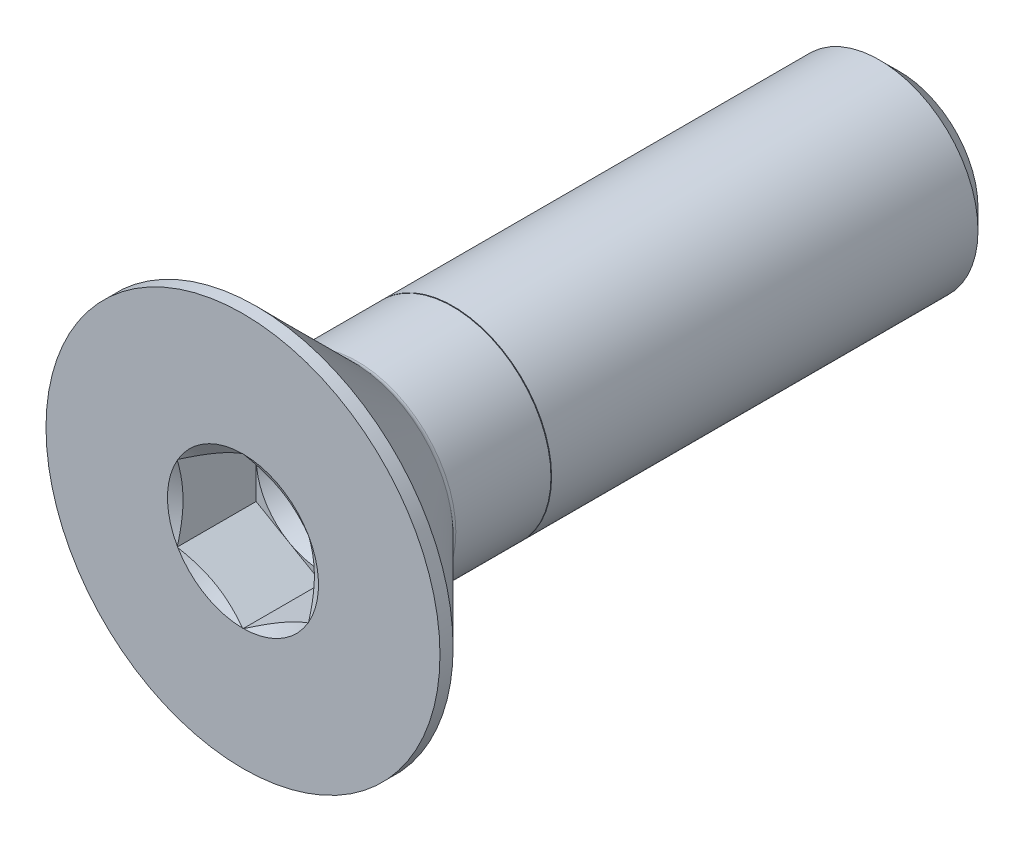
ISO-10303-21;
HEADER;
FILE_DESCRIPTION(('STEP AP214'),'2;1');
FILE_NAME('part.step','',(''),(''),'','','');
FILE_SCHEMA(('AUTOMOTIVE_DESIGN { 1 0 10303 214 1 1 1 1 }'));
ENDSEC;
DATA;
#1=APPLICATION_CONTEXT('core data for automotive mechanical design processes');
#2=APPLICATION_PROTOCOL_DEFINITION('international standard','automotive_design',2000,#1);
#3=PRODUCT_CONTEXT('',#1,'mechanical');
#4=PRODUCT('Part','Part','',(#3));
#5=PRODUCT_RELATED_PRODUCT_CATEGORY('part','',(#4));
#6=PRODUCT_DEFINITION_FORMATION('','',#4);
#7=PRODUCT_DEFINITION_CONTEXT('part definition',#1,'design');
#8=PRODUCT_DEFINITION('design','',#6,#7);
#9=PRODUCT_DEFINITION_SHAPE('','',#8);
#10=(LENGTH_UNIT() NAMED_UNIT(*) SI_UNIT(.MILLI.,.METRE.));
#11=(NAMED_UNIT(*) PLANE_ANGLE_UNIT() SI_UNIT($,.RADIAN.));
#12=(NAMED_UNIT(*) SI_UNIT($,.STERADIAN.) SOLID_ANGLE_UNIT());
#13=UNCERTAINTY_MEASURE_WITH_UNIT(LENGTH_MEASURE(1.E-05),#10,'distance_accuracy_value','');
#14=(GEOMETRIC_REPRESENTATION_CONTEXT(3) GLOBAL_UNCERTAINTY_ASSIGNED_CONTEXT((#13)) GLOBAL_UNIT_ASSIGNED_CONTEXT((#10,
#11,#12)) REPRESENTATION_CONTEXT('',''));
#15=CARTESIAN_POINT('',(0.,0.,0.));
#16=DIRECTION('',(0.,0.,1.));
#17=DIRECTION('',(1.,0.,0.));
#18=AXIS2_PLACEMENT_3D('',#15,#16,#17);
#19=CARTESIAN_POINT('',(0.,0.,1.25));
#20=DIRECTION('',(-1.,0.,0.));
#21=DIRECTION('',(0.,1.,0.));
#22=AXIS2_PLACEMENT_3D('',#19,#20,#21);
#23=SPHERICAL_SURFACE('',#22,1.25);
#24=CARTESIAN_POINT('',(-1.,0.,0.5));
#25=CARTESIAN_POINT('',(-0.999999918221247,-0.0281495245521416,0.5));
#26=CARTESIAN_POINT('',(-0.998810705131522,-0.0562856859630076,0.5));
#27=CARTESIAN_POINT('',(-0.994066576687322,-0.112356361404446,0.5));
#28=CARTESIAN_POINT('',(-0.990511783141581,-0.140290885742875,0.5));
#29=CARTESIAN_POINT('',(-0.976343201238138,-0.223384369013001,0.5));
#30=CARTESIAN_POINT('',(-0.962225042161326,-0.27798690137359,0.5));
#31=CARTESIAN_POINT('',(-0.925017617018385,-0.384066836858397,0.5));
#32=CARTESIAN_POINT('',(-0.901921159244324,-0.435541696368237,0.5));
#33=CARTESIAN_POINT('',(-0.847420007360541,-0.533893955867315,0.5));
#34=CARTESIAN_POINT('',(-0.816013396339763,-0.580770291686499,0.5));
#35=CARTESIAN_POINT('',(-0.742139756291213,-0.673099775905201,0.5));
#36=CARTESIAN_POINT('',(-0.698870858918713,-0.717918970422269,0.5));
#37=CARTESIAN_POINT('',(-0.628318945194335,-0.778580151446536,0.5));
#38=CARTESIAN_POINT('',(-0.603808211615082,-0.797736065958106,0.5));
#39=CARTESIAN_POINT('',(-0.553112162603095,-0.833685170069625,0.5));
#40=CARTESIAN_POINT('',(-0.526926888504461,-0.850478417956551,0.5));
#41=CARTESIAN_POINT('',(-0.5,-0.866025403784439,0.5));
#42=B_SPLINE_CURVE_WITH_KNOTS('',3,(#24,#25,#26,#27,#28,#29,#30,#31,#32,#33,#34,#35,#36,#37,#38,
#39,#40,#41),.UNSPECIFIED.,.F.,.F.,(4,2,2,2,2,2,2,2,4),(0.,0.0843969221510993,0.168789498862693,
0.337119537320777,0.505584688602224,0.674088733831015,0.859796862820128,0.953005960941174,
1.04621275919071),.UNSPECIFIED.);
#43=CARTESIAN_POINT('',(-1.,0.,0.5));
#44=VERTEX_POINT('',#43);
#45=CARTESIAN_POINT('',(-0.5,-0.866025403784438,0.5));
#46=VERTEX_POINT('',#45);
#47=EDGE_CURVE('E20',#44,#46,#42,.T.);
#48=ORIENTED_EDGE('',*,*,#47,.T.);
#49=CARTESIAN_POINT('',(-0.5,-0.866025403784439,0.5));
#50=CARTESIAN_POINT('',(-0.475621755744015,-0.880100095238032,0.5));
#51=CARTESIAN_POINT('',(-0.450660518652364,-0.89313828719725,0.5));
#52=CARTESIAN_POINT('',(-0.399729825090627,-0.917065089166476,0.5));
#53=CARTESIAN_POINT('',(-0.373760420598042,-0.927953809819869,0.5));
#54=CARTESIAN_POINT('',(-0.294715062245455,-0.95723019959095,0.500000000000001));
#55=CARTESIAN_POINT('',(-0.240368802571818,-0.972304781356058,0.500000000000003));
#56=CARTESIAN_POINT('',(-0.129897171038692,-0.993122173715266,0.500000000000003));
#57=CARTESIAN_POINT('',(-0.0737704061599044,-0.998857484300414,0.500000000000001));
#58=CARTESIAN_POINT('',(0.0386557250277878,-1.00083423198308,0.499999999999999));
#59=CARTESIAN_POINT('',(0.094955128193921,-0.997073476901905,0.500000000000001));
#60=CARTESIAN_POINT('',(0.211851627069907,-0.979261770059184,0.500000000000001));
#61=CARTESIAN_POINT('',(0.272300636785095,-0.964199402999392,0.5));
#62=CARTESIAN_POINT('',(0.360110717437866,-0.933430243940605,0.5));
#63=CARTESIAN_POINT('',(0.388955592827236,-0.921781283251364,0.5));
#64=CARTESIAN_POINT('',(0.445436454737096,-0.895851768991243,0.5));
#65=CARTESIAN_POINT('',(0.473072471068542,-0.881571280360231,0.500000000000001));
#66=CARTESIAN_POINT('',(0.500000000000001,-0.866025403784441,0.500000000000003));
#67=B_SPLINE_CURVE_WITH_KNOTS('',3,(#49,#50,#51,#52,#53,#54,#55,#56,#57,#58,#59,#60,#61,#62,#63,
#64,#65,#66),.UNSPECIFIED.,.F.,.F.,(4,2,2,2,2,2,2,2,4),(0.,0.0843969221510981,0.168789498862691,
0.337119537320774,0.50558468860222,0.674088733831011,0.859796862820125,0.953005960941173,
1.04621275919071),.UNSPECIFIED.);
#68=CARTESIAN_POINT('',(0.5,-0.866025403784439,0.5));
#69=VERTEX_POINT('',#68);
#70=EDGE_CURVE('E922',#46,#69,#67,.T.);
#71=ORIENTED_EDGE('',*,*,#70,.T.);
#72=CARTESIAN_POINT('',(0.5,-0.866025403784439,0.5));
#73=CARTESIAN_POINT('',(0.524378162477232,-0.851950570685891,0.5));
#74=CARTESIAN_POINT('',(0.548150186479159,-0.836852601234242,0.5));
#75=CARTESIAN_POINT('',(0.594336751596697,-0.80470872776203,0.5));
#76=CARTESIAN_POINT('',(0.61675136254354,-0.787662924076995,0.5));
#77=CARTESIAN_POINT('',(0.681628138992685,-0.73384583057795,0.5));
#78=CARTESIAN_POINT('',(0.721856239589512,-0.694317879982466,0.500000000000001));
#79=CARTESIAN_POINT('',(0.795120445979699,-0.609055336856868,0.500000000000001));
#80=CARTESIAN_POINT('',(0.828150753084425,-0.563315787932176,0.5));
#81=CARTESIAN_POINT('',(0.886075732388333,-0.466940276115767,0.5));
#82=CARTESIAN_POINT('',(0.910968524533688,-0.416303185215404,0.5));
#83=CARTESIAN_POINT('',(0.953991383361123,-0.306161994153981,0.5));
#84=CARTESIAN_POINT('',(0.971171495703811,-0.246280432577121,0.5));
#85=CARTESIAN_POINT('',(0.988429662632203,-0.154850092494069,0.5));
#86=CARTESIAN_POINT('',(0.992763804442319,-0.124045217293258,0.5));
#87=CARTESIAN_POINT('',(0.998548617340193,-0.0621665989216179,0.5));
#88=CARTESIAN_POINT('',(0.999999359573003,-0.0310928624036789,0.5));
#89=CARTESIAN_POINT('',(1.,0.,0.5));
#90=B_SPLINE_CURVE_WITH_KNOTS('',3,(#72,#73,#74,#75,#76,#77,#78,#79,#80,#81,#82,#83,#84,#85,#86,
#87,#88,#89),.UNSPECIFIED.,.F.,.F.,(4,2,2,2,2,2,2,2,4),(0.,0.0843969221510994,0.168789498862694,
0.337119537320778,0.505584688602225,0.674088733831016,0.859796862820128,0.953005960941174,
1.04621275919071),.UNSPECIFIED.);
#91=CARTESIAN_POINT('',(1.,0.,0.5));
#92=VERTEX_POINT('',#91);
#93=EDGE_CURVE('E927',#69,#92,#90,.T.);
#94=ORIENTED_EDGE('',*,*,#93,.T.);
#95=CARTESIAN_POINT('',(1.,0.,0.5));
#96=CARTESIAN_POINT('',(0.999999918221247,0.0281495245521418,0.5));
#97=CARTESIAN_POINT('',(0.998810705131522,0.0562856859630077,0.5));
#98=CARTESIAN_POINT('',(0.994066576687322,0.112356361404446,0.5));
#99=CARTESIAN_POINT('',(0.990511783141581,0.140290885742875,0.5));
#100=CARTESIAN_POINT('',(0.976343201238138,0.223384369013001,0.5));
#101=CARTESIAN_POINT('',(0.962225042161326,0.27798690137359,0.5));
#102=CARTESIAN_POINT('',(0.925017617018385,0.384066836858397,0.5));
#103=CARTESIAN_POINT('',(0.901921159244324,0.435541696368237,0.5));
#104=CARTESIAN_POINT('',(0.847420007360541,0.533893955867315,0.5));
#105=CARTESIAN_POINT('',(0.816013396339763,0.580770291686499,0.5));
#106=CARTESIAN_POINT('',(0.742139756291213,0.673099775905201,0.5));
#107=CARTESIAN_POINT('',(0.698870858918713,0.717918970422269,0.5));
#108=CARTESIAN_POINT('',(0.628318945194336,0.778580151446535,0.5));
#109=CARTESIAN_POINT('',(0.603808211615082,0.797736065958105,0.5));
#110=CARTESIAN_POINT('',(0.553112162603096,0.833685170069624,0.5));
#111=CARTESIAN_POINT('',(0.526926888504462,0.850478417956551,0.5));
#112=CARTESIAN_POINT('',(0.5,0.866025403784439,0.5));
#113=B_SPLINE_CURVE_WITH_KNOTS('',3,(#95,#96,#97,#98,#99,#100,#101,#102,#103,#104,#105,#106,
#107,#108,#109,#110,#111,#112),.UNSPECIFIED.,.F.,.F.,(4,2,2,2,2,2,2,2,4),(0.,0.0843969221510991,
0.168789498862693,0.337119537320777,0.505584688602224,0.674088733831015,0.859796862820127,
0.953005960941174,1.04621275919071),.UNSPECIFIED.);
#114=CARTESIAN_POINT('',(0.5,0.866025403784438,0.5));
#115=VERTEX_POINT('',#114);
#116=EDGE_CURVE('E383',#92,#115,#113,.T.);
#117=ORIENTED_EDGE('',*,*,#116,.T.);
#118=CARTESIAN_POINT('',(0.5,0.866025403784439,0.5));
#119=CARTESIAN_POINT('',(0.475621755744015,0.880100095238032,0.5));
#120=CARTESIAN_POINT('',(0.450660518652364,0.89313828719725,0.5));
#121=CARTESIAN_POINT('',(0.399729825090626,0.917065089166476,0.5));
#122=CARTESIAN_POINT('',(0.373760420598042,0.927953809819869,0.5));
#123=CARTESIAN_POINT('',(0.294715062245455,0.95723019959095,0.500000000000001));
#124=CARTESIAN_POINT('',(0.240368802571818,0.972304781356058,0.500000000000003));
#125=CARTESIAN_POINT('',(0.129897171038691,0.993122173715267,0.500000000000003));
#126=CARTESIAN_POINT('',(0.0737704061599038,0.998857484300414,0.500000000000001));
#127=CARTESIAN_POINT('',(-0.0386557250277884,1.00083423198308,0.499999999999999));
#128=CARTESIAN_POINT('',(-0.0949551281939217,0.997073476901905,0.500000000000001));
#129=CARTESIAN_POINT('',(-0.211851627069907,0.979261770059184,0.500000000000001));
#130=CARTESIAN_POINT('',(-0.272300636785095,0.964199402999392,0.5));
#131=CARTESIAN_POINT('',(-0.360110717437866,0.933430243940605,0.5));
#132=CARTESIAN_POINT('',(-0.388955592827235,0.921781283251364,0.5));
#133=CARTESIAN_POINT('',(-0.445436454737096,0.895851768991243,0.5));
#134=CARTESIAN_POINT('',(-0.473072471068541,0.881571280360231,0.500000000000001));
#135=CARTESIAN_POINT('',(-0.5,0.866025403784441,0.500000000000003));
#136=B_SPLINE_CURVE_WITH_KNOTS('',3,(#118,#119,#120,#121,#122,#123,#124,#125,#126,#127,#128,
#129,#130,#131,#132,#133,#134,#135),.UNSPECIFIED.,.F.,.F.,(4,2,2,2,2,2,2,2,4),(0.,
0.0843969221510984,0.168789498862692,0.337119537320774,0.505584688602221,0.674088733831012,
0.859796862820126,0.953005960941173,1.04621275919071),.UNSPECIFIED.);
#137=CARTESIAN_POINT('',(-0.499999999999999,0.866025403784439,0.5));
#138=VERTEX_POINT('',#137);
#139=EDGE_CURVE('E382',#115,#138,#136,.T.);
#140=ORIENTED_EDGE('',*,*,#139,.T.);
#141=CARTESIAN_POINT('',(-0.499999999999999,0.866025403784439,0.5));
#142=CARTESIAN_POINT('',(-0.524378162477231,0.851950570685891,0.5));
#143=CARTESIAN_POINT('',(-0.548150186479158,0.836852601234243,0.5));
#144=CARTESIAN_POINT('',(-0.594336751596696,0.804708727762031,0.5));
#145=CARTESIAN_POINT('',(-0.61675136254354,0.787662924076995,0.5));
#146=CARTESIAN_POINT('',(-0.681628138992685,0.73384583057795,0.5));
#147=CARTESIAN_POINT('',(-0.721856239589512,0.694317879982467,0.500000000000001));
#148=CARTESIAN_POINT('',(-0.795120445979698,0.609055336856869,0.500000000000001));
#149=CARTESIAN_POINT('',(-0.828150753084424,0.563315787932177,0.5));
#150=CARTESIAN_POINT('',(-0.886075732388333,0.466940276115768,0.5));
#151=CARTESIAN_POINT('',(-0.910968524533688,0.416303185215405,0.5));
#152=CARTESIAN_POINT('',(-0.953991383361123,0.306161994153982,0.5));
#153=CARTESIAN_POINT('',(-0.971171495703811,0.246280432577122,0.5));
#154=CARTESIAN_POINT('',(-0.988429662632203,0.15485009249407,0.5));
#155=CARTESIAN_POINT('',(-0.992763804442319,0.124045217293259,0.5));
#156=CARTESIAN_POINT('',(-0.998548617340193,0.0621665989216183,0.5));
#157=CARTESIAN_POINT('',(-0.999999359573004,0.0310928624036792,0.5));
#158=CARTESIAN_POINT('',(-1.,0.,0.5));
#159=B_SPLINE_CURVE_WITH_KNOTS('',3,(#141,#142,#143,#144,#145,#146,#147,#148,#149,#150,#151,
#152,#153,#154,#155,#156,#157,#158),.UNSPECIFIED.,.F.,.F.,(4,2,2,2,2,2,2,2,4),(0.,
0.0843969221510994,0.168789498862693,0.337119537320778,0.505584688602224,0.674088733831015,
0.859796862820128,0.953005960941175,1.04621275919071),.UNSPECIFIED.);
#160=EDGE_CURVE('E100',#138,#44,#159,.T.);
#161=ORIENTED_EDGE('',*,*,#160,.T.);
#162=EDGE_LOOP('',(#48,#71,#94,#117,#140,#161));
#163=FACE_BOUND('',#162,.T.);
#164=ADVANCED_FACE('F15',(#163),#23,.F.);
#165=CARTESIAN_POINT('',(1.,1.73205080756888,0.5));
#166=DIRECTION('',(0.,0.,-1.));
#167=DIRECTION('',(-1.,0.,0.));
#168=AXIS2_PLACEMENT_3D('',#165,#166,#167);
#169=PLANE('',#168);
#170=DIRECTION('',(0.,1.,0.));
#171=VECTOR('',#170,1.);
#172=CARTESIAN_POINT('',(-1.,-0.577350269189626,0.5));
#173=LINE('',#172,#171);
#174=CARTESIAN_POINT('',(-1.,-0.577350269189625,0.5));
#175=VERTEX_POINT('',#174);
#176=EDGE_CURVE('E107',#175,#44,#173,.T.);
#177=ORIENTED_EDGE('',*,*,#176,.F.);
#178=DIRECTION('',(-0.866025403784439,0.5,0.));
#179=VECTOR('',#178,1.);
#180=CARTESIAN_POINT('',(0.,-1.15470053837925,0.5));
#181=LINE('',#180,#179);
#182=EDGE_CURVE('E247',#46,#175,#181,.T.);
#183=ORIENTED_EDGE('',*,*,#182,.F.);
#184=ORIENTED_EDGE('',*,*,#47,.F.);
#185=EDGE_LOOP('',(#177,#183,#184));
#186=FACE_BOUND('',#185,.T.);
#187=ADVANCED_FACE('F644',(#186),#169,.F.);
#188=CARTESIAN_POINT('',(1.,1.73205080756888,0.5));
#189=DIRECTION('',(0.,0.,-1.));
#190=DIRECTION('',(-1.,0.,0.));
#191=AXIS2_PLACEMENT_3D('',#188,#189,#190);
#192=PLANE('',#191);
#193=DIRECTION('',(-0.866025403784439,0.5,0.));
#194=VECTOR('',#193,1.);
#195=CARTESIAN_POINT('',(0.,-1.15470053837925,0.5));
#196=LINE('',#195,#194);
#197=CARTESIAN_POINT('',(0.,-1.15470053837925,0.5));
#198=VERTEX_POINT('',#197);
#199=EDGE_CURVE('E282',#198,#46,#196,.T.);
#200=ORIENTED_EDGE('',*,*,#199,.F.);
#201=DIRECTION('',(-0.866025403784439,-0.5,0.));
#202=VECTOR('',#201,1.);
#203=CARTESIAN_POINT('',(1.,-0.577350269189626,0.5));
#204=LINE('',#203,#202);
#205=EDGE_CURVE('E240',#69,#198,#204,.T.);
#206=ORIENTED_EDGE('',*,*,#205,.F.);
#207=ORIENTED_EDGE('',*,*,#70,.F.);
#208=EDGE_LOOP('',(#200,#206,#207));
#209=FACE_BOUND('',#208,.T.);
#210=ADVANCED_FACE('F632',(#209),#192,.F.);
#211=CARTESIAN_POINT('',(1.,1.73205080756888,0.5));
#212=DIRECTION('',(0.,0.,-1.));
#213=DIRECTION('',(-1.,0.,0.));
#214=AXIS2_PLACEMENT_3D('',#211,#212,#213);
#215=PLANE('',#214);
#216=DIRECTION('',(-0.866025403784439,-0.5,0.));
#217=VECTOR('',#216,1.);
#218=CARTESIAN_POINT('',(1.,-0.577350269189626,0.5));
#219=LINE('',#218,#217);
#220=CARTESIAN_POINT('',(1.,-0.577350269189626,0.5));
#221=VERTEX_POINT('',#220);
#222=EDGE_CURVE('E273',#221,#69,#219,.T.);
#223=ORIENTED_EDGE('',*,*,#222,.F.);
#224=DIRECTION('',(0.,1.,0.));
#225=VECTOR('',#224,1.);
#226=CARTESIAN_POINT('',(1.,0.577350269189626,0.5));
#227=LINE('',#226,#225);
#228=EDGE_CURVE('E233',#92,#221,#227,.F.);
#229=ORIENTED_EDGE('',*,*,#228,.F.);
#230=ORIENTED_EDGE('',*,*,#93,.F.);
#231=EDGE_LOOP('',(#223,#229,#230));
#232=FACE_BOUND('',#231,.T.);
#233=ADVANCED_FACE('F621',(#232),#215,.F.);
#234=CARTESIAN_POINT('',(1.,1.73205080756888,0.5));
#235=DIRECTION('',(0.,0.,-1.));
#236=DIRECTION('',(-1.,0.,0.));
#237=AXIS2_PLACEMENT_3D('',#234,#235,#236);
#238=PLANE('',#237);
#239=DIRECTION('',(0.,1.,0.));
#240=VECTOR('',#239,1.);
#241=CARTESIAN_POINT('',(1.,0.577350269189626,0.5));
#242=LINE('',#241,#240);
#243=CARTESIAN_POINT('',(1.,0.577350269189624,0.5));
#244=VERTEX_POINT('',#243);
#245=EDGE_CURVE('E265',#244,#92,#242,.F.);
#246=ORIENTED_EDGE('',*,*,#245,.F.);
#247=DIRECTION('',(0.866025403784439,-0.5,0.));
#248=VECTOR('',#247,1.);
#249=CARTESIAN_POINT('',(0.,1.15470053837925,0.5));
#250=LINE('',#249,#248);
#251=EDGE_CURVE('E227',#115,#244,#250,.T.);
#252=ORIENTED_EDGE('',*,*,#251,.F.);
#253=ORIENTED_EDGE('',*,*,#116,.F.);
#254=EDGE_LOOP('',(#246,#252,#253));
#255=FACE_BOUND('',#254,.T.);
#256=ADVANCED_FACE('F393',(#255),#238,.F.);
#257=CARTESIAN_POINT('',(1.,1.73205080756888,0.5));
#258=DIRECTION('',(0.,0.,-1.));
#259=DIRECTION('',(-1.,0.,0.));
#260=AXIS2_PLACEMENT_3D('',#257,#258,#259);
#261=PLANE('',#260);
#262=DIRECTION('',(0.866025403784439,0.5,0.));
#263=VECTOR('',#262,1.);
#264=CARTESIAN_POINT('',(-1.,0.577350269189626,0.5));
#265=LINE('',#264,#263);
#266=CARTESIAN_POINT('',(-1.,0.577350269189626,0.5));
#267=VERTEX_POINT('',#266);
#268=EDGE_CURVE('E218',#267,#138,#265,.T.);
#269=ORIENTED_EDGE('',*,*,#268,.F.);
#270=DIRECTION('',(0.,1.,0.));
#271=VECTOR('',#270,1.);
#272=CARTESIAN_POINT('',(-1.,-0.577350269189626,0.5));
#273=LINE('',#272,#271);
#274=EDGE_CURVE('E260',#44,#267,#273,.T.);
#275=ORIENTED_EDGE('',*,*,#274,.F.);
#276=ORIENTED_EDGE('',*,*,#160,.F.);
#277=EDGE_LOOP('',(#269,#275,#276));
#278=FACE_BOUND('',#277,.T.);
#279=ADVANCED_FACE('F381',(#278),#261,.F.);
#280=CARTESIAN_POINT('',(1.,1.73205080756888,0.5));
#281=DIRECTION('',(0.,0.,-1.));
#282=DIRECTION('',(-1.,0.,0.));
#283=AXIS2_PLACEMENT_3D('',#280,#281,#282);
#284=PLANE('',#283);
#285=DIRECTION('',(0.866025403784439,-0.5,0.));
#286=VECTOR('',#285,1.);
#287=CARTESIAN_POINT('',(0.,1.15470053837925,0.5));
#288=LINE('',#287,#286);
#289=CARTESIAN_POINT('',(0.,1.15470053837925,0.5));
#290=VERTEX_POINT('',#289);
#291=EDGE_CURVE('E250',#290,#115,#288,.T.);
#292=ORIENTED_EDGE('',*,*,#291,.F.);
#293=DIRECTION('',(0.866025403784439,0.5,0.));
#294=VECTOR('',#293,1.);
#295=CARTESIAN_POINT('',(-1.,0.577350269189626,0.5));
#296=LINE('',#295,#294);
#297=EDGE_CURVE('E155',#138,#290,#296,.T.);
#298=ORIENTED_EDGE('',*,*,#297,.F.);
#299=ORIENTED_EDGE('',*,*,#139,.F.);
#300=EDGE_LOOP('',(#292,#298,#299));
#301=FACE_BOUND('',#300,.T.);
#302=ADVANCED_FACE('F387',(#301),#284,.F.);
#303=CARTESIAN_POINT('',(0.,0.,1.70000000008486));
#304=DIRECTION('',(0.,0.,1.));
#305=DIRECTION('',(1.,0.,0.));
#306=AXIS2_PLACEMENT_3D('',#303,#304,#305);
#307=CONICAL_SURFACE('',#306,1.15000000010923,1.04719755122045);
#308=CARTESIAN_POINT('',(-1.,0.567890834581807,1.7000000000223));
#309=CARTESIAN_POINT('',(-1.,0.517307283570297,1.68557228640608));
#310=CARTESIAN_POINT('',(-1.,0.466286843365992,1.67248535056143));
#311=CARTESIAN_POINT('',(-1.,0.363375742919932,1.6497210302096));
#312=CARTESIAN_POINT('',(-1.,0.311483350352291,1.64005156082042));
#313=CARTESIAN_POINT('',(-1.,0.208337012798557,1.62510771139287));
#314=CARTESIAN_POINT('',(-1.,0.157098286449418,1.61973205109716));
#315=CARTESIAN_POINT('',(-1.,0.0543986608337356,1.61350127394018));
#316=CARTESIAN_POINT('',(-1.,0.00293809753266549,1.61264079808044));
#317=CARTESIAN_POINT('',(-1.,-0.0919765232483634,1.61528923603533));
#318=CARTESIAN_POINT('',(-1.,-0.135450325752679,1.61814945267443));
#319=CARTESIAN_POINT('',(-1.,-0.22208711691931,1.62695146739236));
#320=CARTESIAN_POINT('',(-1.,-0.26525005663329,1.6328937404608));
#321=CARTESIAN_POINT('',(-1.,-0.352029208151982,1.6476476866478));
#322=CARTESIAN_POINT('',(-1.,-0.395635111577935,1.65651849403495));
#323=CARTESIAN_POINT('',(-1.,-0.482222992957887,1.67661181673736));
#324=CARTESIAN_POINT('',(-1.,-0.525205953111748,1.68783006810734));
#325=CARTESIAN_POINT('',(-1.,-0.567890834581807,1.7000000000223));
#326=B_SPLINE_CURVE_WITH_KNOTS('',3,(#308,#309,#310,#311,#312,#313,#314,#315,#316,#317,#318,
#319,#320,#321,#322,#323,#324,#325),.UNSPECIFIED.,.F.,.F.,(4,2,2,2,2,2,2,2,4),(0.,
0.157864083189179,0.316091432118757,0.470466224218563,0.624657749893881,0.755245826329913,
0.885854034266176,1.01927976317709,1.15246520657173),.UNSPECIFIED.);
#327=CARTESIAN_POINT('',(-1.,0.56789083463396,1.70000000003717));
#328=VERTEX_POINT('',#327);
#329=CARTESIAN_POINT('',(-1.,-0.56789083463396,1.70000000003717));
#330=VERTEX_POINT('',#329);
#331=EDGE_CURVE('E292',#328,#330,#326,.T.);
#332=ORIENTED_EDGE('',*,*,#331,.F.);
#333=CARTESIAN_POINT('',(0.,0.,1.70000000005204));
#334=DIRECTION('',(0.,0.,1.));
#335=DIRECTION('',(1.,0.,0.));
#336=AXIS2_PLACEMENT_3D('',#333,#334,#335);
#337=CIRCLE('',#336,1.15000000005239);
#338=EDGE_CURVE('E208',#328,#330,#337,.T.);
#339=ORIENTED_EDGE('',*,*,#338,.T.);
#340=EDGE_LOOP('',(#332,#339));
#341=FACE_BOUND('',#340,.T.);
#342=ADVANCED_FACE('F579',(#341),#307,.F.);
#343=CARTESIAN_POINT('',(-1.,-0.577350269189626,0.5));
#344=DIRECTION('',(1.,0.,0.));
#345=DIRECTION('',(0.,0.,-1.));
#346=AXIS2_PLACEMENT_3D('',#343,#344,#345);
#347=PLANE('',#346);
#348=ORIENTED_EDGE('',*,*,#274,.T.);
#349=DIRECTION('',(0.,0.,1.));
#350=VECTOR('',#349,1.);
#351=CARTESIAN_POINT('',(-1.,0.577350269189626,0.5));
#352=LINE('',#351,#350);
#353=CARTESIAN_POINT('',(-1.,0.577350269189626,1.7));
#354=VERTEX_POINT('',#353);
#355=EDGE_CURVE('E215',#354,#267,#352,.F.);
#356=ORIENTED_EDGE('',*,*,#355,.F.);
#357=DIRECTION('',(0.,1.,0.));
#358=VECTOR('',#357,1.);
#359=CARTESIAN_POINT('',(-1.,0.,1.7));
#360=LINE('',#359,#358);
#361=EDGE_CURVE('E156',#354,#328,#360,.F.);
#362=ORIENTED_EDGE('',*,*,#361,.T.);
#363=ORIENTED_EDGE('',*,*,#331,.T.);
#364=DIRECTION('',(0.,1.,0.));
#365=VECTOR('',#364,1.);
#366=CARTESIAN_POINT('',(-1.,0.,1.7));
#367=LINE('',#366,#365);
#368=CARTESIAN_POINT('',(-1.,-0.577350269189626,1.7));
#369=VERTEX_POINT('',#368);
#370=EDGE_CURVE('E204',#330,#369,#367,.F.);
#371=ORIENTED_EDGE('',*,*,#370,.T.);
#372=DIRECTION('',(0.,0.,1.));
#373=VECTOR('',#372,1.);
#374=CARTESIAN_POINT('',(-1.,-0.577350269189625,0.5));
#375=LINE('',#374,#373);
#376=EDGE_CURVE('E243',#175,#369,#375,.T.);
#377=ORIENTED_EDGE('',*,*,#376,.F.);
#378=ORIENTED_EDGE('',*,*,#176,.T.);
#379=EDGE_LOOP('',(#348,#356,#362,#363,#371,#377,#378));
#380=FACE_BOUND('',#379,.T.);
#381=ADVANCED_FACE('F377',(#380),#347,.T.);
#382=CARTESIAN_POINT('',(0.,0.,1.70000000008486));
#383=DIRECTION('',(0.,0.,1.));
#384=DIRECTION('',(1.,0.,0.));
#385=AXIS2_PLACEMENT_3D('',#382,#383,#384);
#386=CONICAL_SURFACE('',#385,1.15000000010923,1.04719755122801);
#387=CARTESIAN_POINT('',(-0.991807889324193,-0.582079986493534,1.7000000000223));
#388=CARTESIAN_POINT('',(-0.948001249134668,-0.607371761999248,1.68557228640635));
#389=CARTESIAN_POINT('',(-0.903816251805558,-0.632881982101353,1.67248535056195));
#390=CARTESIAN_POINT('',(-0.814692624488052,-0.684337532324271,1.64972103021056));
#391=CARTESIAN_POINT('',(-0.769752494261432,-0.710283728608027,1.64005156082156));
#392=CARTESIAN_POINT('',(-0.680425145632776,-0.761856897384777,1.62510771139427));
#393=CARTESIAN_POINT('',(-0.636051106956952,-0.787476260559295,1.61973205109864));
#394=CARTESIAN_POINT('',(-0.547110622214805,-0.838826073367029,1.61350127394173));
#395=CARTESIAN_POINT('',(-0.502544467103116,-0.864556355017509,1.61264079808197));
#396=CARTESIAN_POINT('',(-0.420345994316184,-0.912013665408021,1.61528923603674));
#397=CARTESIAN_POINT('',(-0.382696576948251,-0.933750566660229,1.61814945267577));
#398=CARTESIAN_POINT('',(-0.307666914895396,-0.977068962243652,1.62695146739352));
#399=CARTESIAN_POINT('',(-0.270286712600976,-0.998650432100698,1.63289374046186));
#400=CARTESIAN_POINT('',(-0.195133762866746,-1.04204000786015,1.6476476866486));
#401=CARTESIAN_POINT('',(-0.157369942744814,-1.06384295957318,1.65651849403561));
#402=CARTESIAN_POINT('',(-0.0823826378097128,-1.10713690026326,1.6766118167377));
#403=CARTESIAN_POINT('',(-0.045158302386513,-1.12862838034025,1.68783006810752));
#404=CARTESIAN_POINT('',(-0.00819211067580559,-1.14997082107534,1.7000000000223));
#405=B_SPLINE_CURVE_WITH_KNOTS('',3,(#387,#388,#389,#390,#391,#392,#393,#394,#395,#396,#397,
#398,#399,#400,#401,#402,#403,#404),.UNSPECIFIED.,.F.,.F.,(4,2,2,2,2,2,2,2,4),(0.,
0.15786408318872,0.316091432117823,0.470466224217302,0.624657749892301,0.755245826328625,
0.885854034265182,1.01927976317631,1.15246520657116),.UNSPECIFIED.);
#406=CARTESIAN_POINT('',(-0.991807889369357,-0.582079986467459,1.70000000003717));
#407=VERTEX_POINT('',#406);
#408=CARTESIAN_POINT('',(-0.00819211063063935,-1.14997082110142,1.70000000003717));
#409=VERTEX_POINT('',#408);
#410=EDGE_CURVE('E262',#407,#409,#405,.T.);
#411=ORIENTED_EDGE('',*,*,#410,.F.);
#412=CARTESIAN_POINT('',(0.,0.,1.70000000005204));
#413=DIRECTION('',(0.,0.,1.));
#414=DIRECTION('',(1.,0.,0.));
#415=AXIS2_PLACEMENT_3D('',#412,#413,#414);
#416=CIRCLE('',#415,1.15000000005239);
#417=EDGE_CURVE('E198',#407,#409,#416,.T.);
#418=ORIENTED_EDGE('',*,*,#417,.T.);
#419=EDGE_LOOP('',(#411,#418));
#420=FACE_BOUND('',#419,.T.);
#421=ADVANCED_FACE('F556',(#420),#386,.F.);
#422=CARTESIAN_POINT('',(0.,-1.15470053837925,0.5));
#423=DIRECTION('',(0.5,0.866025403784439,0.));
#424=DIRECTION('',(-0.866025403784439,0.5,0.));
#425=AXIS2_PLACEMENT_3D('',#422,#423,#424);
#426=PLANE('',#425);
#427=ORIENTED_EDGE('',*,*,#182,.T.);
#428=ORIENTED_EDGE('',*,*,#376,.T.);
#429=DIRECTION('',(0.866025403784398,-0.500000000000071,0.));
#430=VECTOR('',#429,1.);
#431=CARTESIAN_POINT('',(-1.,-0.577350269189626,1.7));
#432=LINE('',#431,#430);
#433=EDGE_CURVE('E201',#369,#407,#432,.T.);
#434=ORIENTED_EDGE('',*,*,#433,.T.);
#435=ORIENTED_EDGE('',*,*,#410,.T.);
#436=DIRECTION('',(0.866025403784379,-0.500000000000104,0.));
#437=VECTOR('',#436,1.);
#438=CARTESIAN_POINT('',(-0.00819211067734985,-1.14997082107445,1.7));
#439=LINE('',#438,#437);
#440=CARTESIAN_POINT('',(0.,-1.15470053837925,1.7));
#441=VERTEX_POINT('',#440);
#442=EDGE_CURVE('E194',#409,#441,#439,.T.);
#443=ORIENTED_EDGE('',*,*,#442,.T.);
#444=DIRECTION('',(0.,0.,1.));
#445=VECTOR('',#444,1.);
#446=CARTESIAN_POINT('',(0.,-1.15470053837925,0.5));
#447=LINE('',#446,#445);
#448=EDGE_CURVE('E236',#198,#441,#447,.T.);
#449=ORIENTED_EDGE('',*,*,#448,.F.);
#450=ORIENTED_EDGE('',*,*,#199,.T.);
#451=EDGE_LOOP('',(#427,#428,#434,#435,#443,#449,#450));
#452=FACE_BOUND('',#451,.T.);
#453=ADVANCED_FACE('F544',(#452),#426,.T.);
#454=CARTESIAN_POINT('',(0.,0.,1.70000000008486));
#455=DIRECTION('',(0.,0.,1.));
#456=DIRECTION('',(1.,0.,0.));
#457=AXIS2_PLACEMENT_3D('',#454,#455,#456);
#458=CONICAL_SURFACE('',#457,1.15000000010923,1.04719755113992);
#459=CARTESIAN_POINT('',(0.00819211067580504,-1.14997082107534,1.7000000000223));
#460=CARTESIAN_POINT('',(0.0519987508661326,-1.12467904556917,1.68557228640316));
#461=CARTESIAN_POINT('',(0.0961837481962076,-1.0991688254665,1.67248535055583));
#462=CARTESIAN_POINT('',(0.185307375515979,-1.04771327524228,1.64972103019938));
#463=CARTESIAN_POINT('',(0.230247505743901,-1.02176707895777,1.64005156080826));
#464=CARTESIAN_POINT('',(0.319574854374916,-0.970193910179658,1.62510771137795));
#465=CARTESIAN_POINT('',(0.363948893051787,-0.944574547004536,1.61973205108137));
#466=CARTESIAN_POINT('',(0.452889377796087,-0.893224734195559,1.6135012739237));
#467=CARTESIAN_POINT('',(0.497455532908883,-0.86749445254444,1.61264079806414));
#468=CARTESIAN_POINT('',(0.579654005695882,-0.820037142153889,1.61528923602027));
#469=CARTESIAN_POINT('',(0.617303423062794,-0.79830024090227,1.61814945266014));
#470=CARTESIAN_POINT('',(0.692333085113498,-0.754981845320089,1.62695146737998));
#471=CARTESIAN_POINT('',(0.729713287406789,-0.733400375463695,1.63289374044957));
#472=CARTESIAN_POINT('',(0.804866237138894,-0.69001079970547,1.64764768663923));
#473=CARTESIAN_POINT('',(0.842630057259824,-0.668207847993022,1.65651849402793));
#474=CARTESIAN_POINT('',(0.917617362192737,-0.624913907304201,1.67661181673368));
#475=CARTESIAN_POINT('',(0.954841697614751,-0.603422427227896,1.68783006810546));
#476=CARTESIAN_POINT('',(0.991807889324193,-0.582079986493534,1.7000000000223));
#477=B_SPLINE_CURVE_WITH_KNOTS('',3,(#459,#460,#461,#462,#463,#464,#465,#466,#467,#468,#469,
#470,#471,#472,#473,#474,#475,#476),.UNSPECIFIED.,.F.,.F.,(4,2,2,2,2,2,2,2,4),(0.,
0.157864083194066,0.316091432128706,0.470466224232002,0.624657749910719,0.755245826343643,
0.885854034276807,1.01927976318552,1.15246520657787),.UNSPECIFIED.);
#478=CARTESIAN_POINT('',(0.00819211063063814,-1.14997082110142,1.70000000003717));
#479=VERTEX_POINT('',#478);
#480=CARTESIAN_POINT('',(0.991807889369358,-0.582079986467459,1.70000000003717));
#481=VERTEX_POINT('',#480);
#482=EDGE_CURVE('E246',#479,#481,#477,.T.);
#483=ORIENTED_EDGE('',*,*,#482,.F.);
#484=CARTESIAN_POINT('',(0.,0.,1.70000000005204));
#485=DIRECTION('',(0.,0.,1.));
#486=DIRECTION('',(1.,0.,0.));
#487=AXIS2_PLACEMENT_3D('',#484,#485,#486);
#488=CIRCLE('',#487,1.15000000005239);
#489=EDGE_CURVE('E188',#479,#481,#488,.T.);
#490=ORIENTED_EDGE('',*,*,#489,.T.);
#491=EDGE_LOOP('',(#483,#490));
#492=FACE_BOUND('',#491,.T.);
#493=ADVANCED_FACE('F532',(#492),#458,.F.);
#494=CARTESIAN_POINT('',(1.,-0.577350269189626,0.5));
#495=DIRECTION('',(-0.5,0.866025403784439,0.));
#496=DIRECTION('',(-0.866025403784439,-0.5,0.));
#497=AXIS2_PLACEMENT_3D('',#494,#495,#496);
#498=PLANE('',#497);
#499=ORIENTED_EDGE('',*,*,#205,.T.);
#500=ORIENTED_EDGE('',*,*,#448,.T.);
#501=DIRECTION('',(0.866025403784379,0.500000000000104,0.));
#502=VECTOR('',#501,1.);
#503=CARTESIAN_POINT('',(0.,-1.15470053837925,1.7));
#504=LINE('',#503,#502);
#505=EDGE_CURVE('E191',#441,#479,#504,.T.);
#506=ORIENTED_EDGE('',*,*,#505,.T.);
#507=ORIENTED_EDGE('',*,*,#482,.T.);
#508=DIRECTION('',(0.866025403784431,0.500000000000013,0.));
#509=VECTOR('',#508,1.);
#510=CARTESIAN_POINT('',(0.991807889322649,-0.582079986494426,1.7));
#511=LINE('',#510,#509);
#512=CARTESIAN_POINT('',(1.,-0.577350269189626,1.7));
#513=VERTEX_POINT('',#512);
#514=EDGE_CURVE('E184',#481,#513,#511,.T.);
#515=ORIENTED_EDGE('',*,*,#514,.T.);
#516=DIRECTION('',(0.,0.,1.));
#517=VECTOR('',#516,1.);
#518=CARTESIAN_POINT('',(1.,-0.577350269189626,0.5));
#519=LINE('',#518,#517);
#520=EDGE_CURVE('E230',#221,#513,#519,.T.);
#521=ORIENTED_EDGE('',*,*,#520,.F.);
#522=ORIENTED_EDGE('',*,*,#222,.T.);
#523=EDGE_LOOP('',(#499,#500,#506,#507,#515,#521,#522));
#524=FACE_BOUND('',#523,.T.);
#525=ADVANCED_FACE('F520',(#524),#498,.T.);
#526=CARTESIAN_POINT('',(0.,0.,1.70000000008486));
#527=DIRECTION('',(0.,0.,1.));
#528=DIRECTION('',(1.,0.,0.));
#529=AXIS2_PLACEMENT_3D('',#526,#527,#528);
#530=CONICAL_SURFACE('',#529,1.15000000010923,1.04719755115654);
#531=CARTESIAN_POINT('',(1.,-0.567890834581809,1.7000000000223));
#532=CARTESIAN_POINT('',(1.,-0.517307283569627,1.68557228640376));
#533=CARTESIAN_POINT('',(1.,-0.466286843364514,1.67248535055698));
#534=CARTESIAN_POINT('',(1.,-0.363375742916556,1.64972103020149));
#535=CARTESIAN_POINT('',(1.,-0.311483350347824,1.64005156081077));
#536=CARTESIAN_POINT('',(1.,-0.208337012792114,1.62510771138103));
#537=CARTESIAN_POINT('',(1.,-0.157098286442097,1.61973205108463));
#538=CARTESIAN_POINT('',(1.,-0.0543986608246117,1.6135012739271));
#539=CARTESIAN_POINT('',(1.,-0.00293809752261503,1.6126407980675));
#540=CARTESIAN_POINT('',(1.,0.0919765232584707,1.61528923602338));
#541=CARTESIAN_POINT('',(1.,0.135450325761931,1.61814945266309));
#542=CARTESIAN_POINT('',(1.,0.222087116926761,1.62695146738253));
#543=CARTESIAN_POINT('',(1.,0.265250056639795,1.63289374045189));
#544=CARTESIAN_POINT('',(1.,0.352029208156709,1.647647686641));
#545=CARTESIAN_POINT('',(1.,0.395635111581823,1.65651849402938));
#546=CARTESIAN_POINT('',(1.,0.482222992959942,1.67661181673444));
#547=CARTESIAN_POINT('',(1.,0.52520595311281,1.68783006810585));
#548=CARTESIAN_POINT('',(1.,0.567890834581809,1.7000000000223));
#549=B_SPLINE_CURVE_WITH_KNOTS('',3,(#531,#532,#533,#534,#535,#536,#537,#538,#539,#540,#541,
#542,#543,#544,#545,#546,#547,#548),.UNSPECIFIED.,.F.,.F.,(4,2,2,2,2,2,2,2,4),(0.,
0.157864083193057,0.316091432126652,0.470466224229228,0.624657749907243,0.755245826340808,
0.885854034274612,1.01927976318378,1.1524652065766),.UNSPECIFIED.);
#550=CARTESIAN_POINT('',(1.,-0.567890834633961,1.70000000003717));
#551=VERTEX_POINT('',#550);
#552=CARTESIAN_POINT('',(1.,0.567890834633961,1.70000000003717));
#553=VERTEX_POINT('',#552);
#554=EDGE_CURVE('E239',#551,#553,#549,.T.);
#555=ORIENTED_EDGE('',*,*,#554,.F.);
#556=CARTESIAN_POINT('',(0.,0.,1.70000000005204));
#557=DIRECTION('',(0.,0.,1.));
#558=DIRECTION('',(1.,0.,0.));
#559=AXIS2_PLACEMENT_3D('',#556,#557,#558);
#560=CIRCLE('',#559,1.15000000005239);
#561=EDGE_CURVE('E178',#551,#553,#560,.T.);
#562=ORIENTED_EDGE('',*,*,#561,.T.);
#563=EDGE_LOOP('',(#555,#562));
#564=FACE_BOUND('',#563,.T.);
#565=ADVANCED_FACE('F409',(#564),#530,.F.);
#566=CARTESIAN_POINT('',(1.,0.577350269189626,0.5));
#567=DIRECTION('',(-1.,0.,0.));
#568=DIRECTION('',(0.,0.,1.));
#569=AXIS2_PLACEMENT_3D('',#566,#567,#568);
#570=PLANE('',#569);
#571=ORIENTED_EDGE('',*,*,#228,.T.);
#572=ORIENTED_EDGE('',*,*,#520,.T.);
#573=DIRECTION('',(0.,1.,0.));
#574=VECTOR('',#573,1.);
#575=CARTESIAN_POINT('',(1.,0.,1.7));
#576=LINE('',#575,#574);
#577=EDGE_CURVE('E181',#513,#551,#576,.T.);
#578=ORIENTED_EDGE('',*,*,#577,.T.);
#579=ORIENTED_EDGE('',*,*,#554,.T.);
#580=DIRECTION('',(0.,1.,0.));
#581=VECTOR('',#580,1.);
#582=CARTESIAN_POINT('',(1.,0.,1.7));
#583=LINE('',#582,#581);
#584=CARTESIAN_POINT('',(1.,0.577350269189626,1.7));
#585=VERTEX_POINT('',#584);
#586=EDGE_CURVE('E174',#553,#585,#583,.T.);
#587=ORIENTED_EDGE('',*,*,#586,.T.);
#588=DIRECTION('',(0.,0.,1.));
#589=VECTOR('',#588,1.);
#590=CARTESIAN_POINT('',(0.999999999999999,0.577350269189624,0.5));
#591=LINE('',#590,#589);
#592=EDGE_CURVE('E224',#244,#585,#591,.T.);
#593=ORIENTED_EDGE('',*,*,#592,.F.);
#594=ORIENTED_EDGE('',*,*,#245,.T.);
#595=EDGE_LOOP('',(#571,#572,#578,#579,#587,#593,#594));
#596=FACE_BOUND('',#595,.T.);
#597=ADVANCED_FACE('F396',(#596),#570,.T.);
#598=CARTESIAN_POINT('',(0.,0.,1.70000000008486));
#599=DIRECTION('',(0.,0.,1.));
#600=DIRECTION('',(1.,0.,0.));
#601=AXIS2_PLACEMENT_3D('',#598,#599,#600);
#602=CONICAL_SURFACE('',#601,1.15000000010923,1.04719755122801);
#603=CARTESIAN_POINT('',(0.991807889324194,0.582079986493532,1.7000000000223));
#604=CARTESIAN_POINT('',(0.948001249134669,0.607371761999247,1.68557228640635));
#605=CARTESIAN_POINT('',(0.903816251805559,0.632881982101351,1.67248535056195));
#606=CARTESIAN_POINT('',(0.814692624488054,0.684337532324269,1.64972103021056));
#607=CARTESIAN_POINT('',(0.769752494261433,0.710283728608025,1.64005156082156));
#608=CARTESIAN_POINT('',(0.680425145632778,0.761856897384775,1.62510771139427));
#609=CARTESIAN_POINT('',(0.636051106956953,0.787476260559293,1.61973205109864));
#610=CARTESIAN_POINT('',(0.547110622214806,0.838826073367028,1.61350127394173));
#611=CARTESIAN_POINT('',(0.502544467103117,0.864556355017508,1.61264079808197));
#612=CARTESIAN_POINT('',(0.420345994316185,0.912013665408019,1.61528923603674));
#613=CARTESIAN_POINT('',(0.382696576948252,0.933750566660228,1.61814945267577));
#614=CARTESIAN_POINT('',(0.307666914895396,0.977068962243651,1.62695146739352));
#615=CARTESIAN_POINT('',(0.270286712600976,0.998650432100697,1.63289374046186));
#616=CARTESIAN_POINT('',(0.195133762866746,1.04204000786015,1.6476476866486));
#617=CARTESIAN_POINT('',(0.157369942744813,1.06384295957318,1.65651849403561));
#618=CARTESIAN_POINT('',(0.0823826378097116,1.10713690026326,1.6766118167377));
#619=CARTESIAN_POINT('',(0.0451583023865116,1.12862838034025,1.68783006810752));
#620=CARTESIAN_POINT('',(0.00819211067580383,1.14997082107534,1.7000000000223));
#621=B_SPLINE_CURVE_WITH_KNOTS('',3,(#603,#604,#605,#606,#607,#608,#609,#610,#611,#612,#613,
#614,#615,#616,#617,#618,#619,#620),.UNSPECIFIED.,.F.,.F.,(4,2,2,2,2,2,2,2,4),(0.,
0.15786408318872,0.316091432117823,0.470466224217302,0.624657749892301,0.755245826328626,
0.885854034265183,1.01927976317631,1.15246520657116),.UNSPECIFIED.);
#622=CARTESIAN_POINT('',(0.991807889369358,0.582079986467457,1.70000000003717));
#623=VERTEX_POINT('',#622);
#624=CARTESIAN_POINT('',(0.00819211063063755,1.14997082110142,1.70000000003717));
#625=VERTEX_POINT('',#624);
#626=EDGE_CURVE('E143',#623,#625,#621,.T.);
#627=ORIENTED_EDGE('',*,*,#626,.F.);
#628=CARTESIAN_POINT('',(0.,0.,1.70000000005204));
#629=DIRECTION('',(0.,0.,1.));
#630=DIRECTION('',(1.,0.,0.));
#631=AXIS2_PLACEMENT_3D('',#628,#629,#630);
#632=CIRCLE('',#631,1.15000000005239);
#633=EDGE_CURVE('E148',#623,#625,#632,.T.);
#634=ORIENTED_EDGE('',*,*,#633,.T.);
#635=EDGE_LOOP('',(#627,#634));
#636=FACE_BOUND('',#635,.T.);
#637=ADVANCED_FACE('F402',(#636),#602,.F.);
#638=CARTESIAN_POINT('',(0.,1.15470053837925,0.5));
#639=DIRECTION('',(-0.5,-0.866025403784439,0.));
#640=DIRECTION('',(0.866025403784439,-0.5,0.));
#641=AXIS2_PLACEMENT_3D('',#638,#639,#640);
#642=PLANE('',#641);
#643=ORIENTED_EDGE('',*,*,#251,.T.);
#644=ORIENTED_EDGE('',*,*,#592,.T.);
#645=DIRECTION('',(-0.866025403784441,0.499999999999995,0.));
#646=VECTOR('',#645,1.);
#647=CARTESIAN_POINT('',(1.,0.577350269189626,1.7));
#648=LINE('',#647,#646);
#649=EDGE_CURVE('E172',#585,#623,#648,.T.);
#650=ORIENTED_EDGE('',*,*,#649,.T.);
#651=ORIENTED_EDGE('',*,*,#626,.T.);
#652=DIRECTION('',(-0.866025403784379,0.500000000000104,0.));
#653=VECTOR('',#652,1.);
#654=CARTESIAN_POINT('',(0.00819211067734811,1.14997082107445,1.7));
#655=LINE('',#654,#653);
#656=CARTESIAN_POINT('',(0.,1.15470053837925,1.7));
#657=VERTEX_POINT('',#656);
#658=EDGE_CURVE('E135',#625,#657,#655,.T.);
#659=ORIENTED_EDGE('',*,*,#658,.T.);
#660=DIRECTION('',(0.,0.,1.));
#661=VECTOR('',#660,1.);
#662=CARTESIAN_POINT('',(0.,1.15470053837925,0.5));
#663=LINE('',#662,#661);
#664=EDGE_CURVE('E140',#290,#657,#663,.T.);
#665=ORIENTED_EDGE('',*,*,#664,.F.);
#666=ORIENTED_EDGE('',*,*,#291,.T.);
#667=EDGE_LOOP('',(#643,#644,#650,#651,#659,#665,#666));
#668=FACE_BOUND('',#667,.T.);
#669=ADVANCED_FACE('F138',(#668),#642,.T.);
#670=CARTESIAN_POINT('',(0.,0.,1.70000000008486));
#671=DIRECTION('',(0.,0.,1.));
#672=DIRECTION('',(1.,0.,0.));
#673=AXIS2_PLACEMENT_3D('',#670,#671,#672);
#674=CONICAL_SURFACE('',#673,1.15000000010923,1.04719755113992);
#675=CARTESIAN_POINT('',(-0.00819211067580632,1.14997082107534,1.7000000000223));
#676=CARTESIAN_POINT('',(-0.0519987508661339,1.12467904556916,1.68557228640316));
#677=CARTESIAN_POINT('',(-0.096183748196209,1.0991688254665,1.67248535055583));
#678=CARTESIAN_POINT('',(-0.18530737551598,1.04771327524228,1.64972103019938));
#679=CARTESIAN_POINT('',(-0.230247505743902,1.02176707895777,1.64005156080826));
#680=CARTESIAN_POINT('',(-0.319574854374917,0.970193910179658,1.62510771137795));
#681=CARTESIAN_POINT('',(-0.363948893051788,0.944574547004535,1.61973205108137));
#682=CARTESIAN_POINT('',(-0.452889377796088,0.893224734195558,1.6135012739237));
#683=CARTESIAN_POINT('',(-0.497455532908884,0.867494452544439,1.61264079806414));
#684=CARTESIAN_POINT('',(-0.579654005695883,0.820037142153889,1.61528923602027));
#685=CARTESIAN_POINT('',(-0.617303423062795,0.79830024090227,1.61814945266014));
#686=CARTESIAN_POINT('',(-0.692333085113499,0.754981845320089,1.62695146737998));
#687=CARTESIAN_POINT('',(-0.729713287406789,0.733400375463695,1.63289374044957));
#688=CARTESIAN_POINT('',(-0.804866237138894,0.69001079970547,1.64764768663923));
#689=CARTESIAN_POINT('',(-0.842630057259824,0.668207847993022,1.65651849402793));
#690=CARTESIAN_POINT('',(-0.917617362192736,0.624913907304201,1.67661181673368));
#691=CARTESIAN_POINT('',(-0.95484169761475,0.603422427227897,1.68783006810546));
#692=CARTESIAN_POINT('',(-0.991807889324193,0.582079986493535,1.7000000000223));
#693=B_SPLINE_CURVE_WITH_KNOTS('',3,(#675,#676,#677,#678,#679,#680,#681,#682,#683,#684,#685,
#686,#687,#688,#689,#690,#691,#692),.UNSPECIFIED.,.F.,.F.,(4,2,2,2,2,2,2,2,4),(0.,
0.157864083194066,0.316091432128706,0.470466224232002,0.624657749910718,0.755245826343642,
0.885854034276806,1.01927976318552,1.15246520657786),.UNSPECIFIED.);
#694=CARTESIAN_POINT('',(-0.00819211063063966,1.14997082110142,1.70000000003717));
#695=VERTEX_POINT('',#694);
#696=CARTESIAN_POINT('',(-0.991807889369358,0.582079986467459,1.70000000003717));
#697=VERTEX_POINT('',#696);
#698=EDGE_CURVE('E219',#695,#697,#693,.T.);
#699=ORIENTED_EDGE('',*,*,#698,.F.);
#700=CARTESIAN_POINT('',(0.,0.,1.70000000005204));
#701=DIRECTION('',(0.,0.,1.));
#702=DIRECTION('',(1.,0.,0.));
#703=AXIS2_PLACEMENT_3D('',#700,#701,#702);
#704=CIRCLE('',#703,1.15000000005239);
#705=EDGE_CURVE('E37',#695,#697,#704,.T.);
#706=ORIENTED_EDGE('',*,*,#705,.T.);
#707=EDGE_LOOP('',(#699,#706));
#708=FACE_BOUND('',#707,.T.);
#709=ADVANCED_FACE('F336',(#708),#674,.F.);
#710=CARTESIAN_POINT('',(-1.,0.577350269189626,0.5));
#711=DIRECTION('',(0.5,-0.866025403784439,0.));
#712=DIRECTION('',(0.866025403784439,0.5,0.));
#713=AXIS2_PLACEMENT_3D('',#710,#711,#712);
#714=PLANE('',#713);
#715=ORIENTED_EDGE('',*,*,#297,.T.);
#716=ORIENTED_EDGE('',*,*,#664,.T.);
#717=DIRECTION('',(-0.866025403784379,-0.500000000000104,0.));
#718=VECTOR('',#717,1.);
#719=CARTESIAN_POINT('',(0.,1.15470053837925,1.7));
#720=LINE('',#719,#718);
#721=EDGE_CURVE('E147',#657,#695,#720,.T.);
#722=ORIENTED_EDGE('',*,*,#721,.T.);
#723=ORIENTED_EDGE('',*,*,#698,.T.);
#724=DIRECTION('',(-0.866025403784398,-0.500000000000071,0.));
#725=VECTOR('',#724,1.);
#726=CARTESIAN_POINT('',(-0.991807889322648,0.582079986494427,1.7));
#727=LINE('',#726,#725);
#728=EDGE_CURVE('E162',#697,#354,#727,.T.);
#729=ORIENTED_EDGE('',*,*,#728,.T.);
#730=ORIENTED_EDGE('',*,*,#355,.T.);
#731=ORIENTED_EDGE('',*,*,#268,.T.);
#732=EDGE_LOOP('',(#715,#716,#722,#723,#729,#730,#731));
#733=FACE_BOUND('',#732,.T.);
#734=ADVANCED_FACE('F152',(#733),#714,.T.);
#735=CARTESIAN_POINT('',(3.,0.,1.7));
#736=DIRECTION('',(0.,0.,-1.));
#737=DIRECTION('',(-1.,0.,0.));
#738=AXIS2_PLACEMENT_3D('',#735,#736,#737);
#739=PLANE('',#738);
#740=ORIENTED_EDGE('',*,*,#705,.F.);
#741=ORIENTED_EDGE('',*,*,#721,.F.);
#742=ORIENTED_EDGE('',*,*,#658,.F.);
#743=ORIENTED_EDGE('',*,*,#633,.F.);
#744=ORIENTED_EDGE('',*,*,#649,.F.);
#745=ORIENTED_EDGE('',*,*,#586,.F.);
#746=ORIENTED_EDGE('',*,*,#561,.F.);
#747=ORIENTED_EDGE('',*,*,#577,.F.);
#748=ORIENTED_EDGE('',*,*,#514,.F.);
#749=ORIENTED_EDGE('',*,*,#489,.F.);
#750=ORIENTED_EDGE('',*,*,#505,.F.);
#751=ORIENTED_EDGE('',*,*,#442,.F.);
#752=ORIENTED_EDGE('',*,*,#417,.F.);
#753=ORIENTED_EDGE('',*,*,#433,.F.);
#754=ORIENTED_EDGE('',*,*,#370,.F.);
#755=ORIENTED_EDGE('',*,*,#338,.F.);
#756=ORIENTED_EDGE('',*,*,#361,.F.);
#757=ORIENTED_EDGE('',*,*,#728,.F.);
#758=EDGE_LOOP('',(#740,#741,#742,#743,#744,#745,#746,#747,#748,#749,#750,#751,#752,#753,#754,
#755,#756,#757));
#759=FACE_BOUND('',#758,.T.);
#760=CARTESIAN_POINT('',(0.,0.,1.7));
#761=DIRECTION('',(0.,0.,-1.));
#762=DIRECTION('',(-1.,0.,0.));
#763=AXIS2_PLACEMENT_3D('',#760,#761,#762);
#764=CIRCLE('',#763,3.);
#765=CARTESIAN_POINT('',(-3.,0.,1.7));
#766=VERTEX_POINT('',#765);
#767=EDGE_CURVE('E315',#766,#766,#764,.T.);
#768=ORIENTED_EDGE('',*,*,#767,.F.);
#769=EDGE_LOOP('',(#768));
#770=FACE_BOUND('',#769,.T.);
#771=ADVANCED_FACE('F158',(#759,#770),#739,.F.);
#772=CARTESIAN_POINT('',(0.,0.,54.));
#773=DIRECTION('',(0.,0.,-1.));
#774=DIRECTION('',(-1.,0.,0.));
#775=AXIS2_PLACEMENT_3D('',#772,#773,#774);
#776=CYLINDRICAL_SURFACE('',#775,3.);
#777=CARTESIAN_POINT('',(0.,0.,1.49999999996453));
#778=DIRECTION('',(0.,0.,1.));
#779=DIRECTION('',(1.,0.,0.));
#780=AXIS2_PLACEMENT_3D('',#777,#778,#779);
#781=CIRCLE('',#780,2.9999999999859);
#782=CARTESIAN_POINT('',(2.9999999999859,0.,1.49999999996453));
#783=VERTEX_POINT('',#782);
#784=EDGE_CURVE('E317',#783,#783,#781,.F.);
#785=ORIENTED_EDGE('',*,*,#784,.F.);
#786=EDGE_LOOP('',(#785));
#787=FACE_BOUND('',#786,.T.);
#788=ORIENTED_EDGE('',*,*,#767,.T.);
#789=EDGE_LOOP('',(#788));
#790=FACE_BOUND('',#789,.T.);
#791=ADVANCED_FACE('F343',(#787,#790),#776,.T.);
#792=CARTESIAN_POINT('',(0.,0.,1.49999999990769));
#793=DIRECTION('',(0.,0.,1.));
#794=DIRECTION('',(1.,0.,0.));
#795=AXIS2_PLACEMENT_3D('',#792,#793,#794);
#796=CONICAL_SURFACE('',#795,2.99999999987222,0.785398163378123);
#797=ORIENTED_EDGE('',*,*,#784,.T.);
#798=EDGE_LOOP('',(#797));
#799=FACE_BOUND('',#798,.T.);
#800=CARTESIAN_POINT('',(0.,0.,0.0292893218813531));
#801=DIRECTION('',(0.,0.,1.));
#802=DIRECTION('',(1.,0.,0.));
#803=AXIS2_PLACEMENT_3D('',#800,#801,#802);
#804=CIRCLE('',#803,1.52928932188135);
#805=CARTESIAN_POINT('',(1.52928932188135,0.,0.0292893218813531));
#806=VERTEX_POINT('',#805);
#807=EDGE_CURVE('E363',#806,#806,#804,.T.);
#808=ORIENTED_EDGE('',*,*,#807,.T.);
#809=EDGE_LOOP('',(#808));
#810=FACE_BOUND('',#809,.T.);
#811=ADVANCED_FACE('F346',(#799,#810),#796,.T.);
#812=CARTESIAN_POINT('',(0.,0.,-0.0414213562373034));
#813=DIRECTION('',(0.,0.,1.));
#814=DIRECTION('',(1.,0.,0.));
#815=AXIS2_PLACEMENT_3D('',#812,#813,#814);
#816=TOROIDAL_SURFACE('',#815,1.6,0.1);
#817=ORIENTED_EDGE('',*,*,#807,.F.);
#818=EDGE_LOOP('',(#817));
#819=FACE_BOUND('',#818,.T.);
#820=CARTESIAN_POINT('',(0.,0.,-0.0414213562373034));
#821=DIRECTION('',(0.,0.,-1.));
#822=DIRECTION('',(-1.,0.,0.));
#823=AXIS2_PLACEMENT_3D('',#820,#821,#822);
#824=CIRCLE('',#823,1.5);
#825=CARTESIAN_POINT('',(-1.5,0.,-0.0414213562373034));
#826=VERTEX_POINT('',#825);
#827=EDGE_CURVE('E314',#826,#826,#824,.T.);
#828=ORIENTED_EDGE('',*,*,#827,.F.);
#829=EDGE_LOOP('',(#828));
#830=FACE_BOUND('',#829,.T.);
#831=ADVANCED_FACE('F350',(#819,#830),#816,.F.);
#832=CARTESIAN_POINT('',(0.,0.,54.));
#833=DIRECTION('',(0.,0.,-1.));
#834=DIRECTION('',(-1.,0.,0.));
#835=AXIS2_PLACEMENT_3D('',#832,#833,#834);
#836=CYLINDRICAL_SURFACE('',#835,1.5);
#837=CARTESIAN_POINT('',(0.,0.,-1.49));
#838=DIRECTION('',(0.,0.,-1.));
#839=DIRECTION('',(-1.,0.,0.));
#840=AXIS2_PLACEMENT_3D('',#837,#838,#839);
#841=CIRCLE('',#840,1.5);
#842=CARTESIAN_POINT('',(-1.5,0.,-1.49));
#843=VERTEX_POINT('',#842);
#844=EDGE_CURVE('E311',#843,#843,#841,.F.);
#845=ORIENTED_EDGE('',*,*,#844,.T.);
#846=EDGE_LOOP('',(#845));
#847=FACE_BOUND('',#846,.T.);
#848=ORIENTED_EDGE('',*,*,#827,.T.);
#849=EDGE_LOOP('',(#848));
#850=FACE_BOUND('',#849,.T.);
#851=ADVANCED_FACE('F355',(#847,#850),#836,.T.);
#852=CARTESIAN_POINT('',(1.1935,0.,-1.49));
#853=DIRECTION('',(0.,0.,1.));
#854=DIRECTION('',(1.,0.,0.));
#855=AXIS2_PLACEMENT_3D('',#852,#853,#854);
#856=PLANE('',#855);
#857=CARTESIAN_POINT('',(0.,0.,-1.49));
#858=DIRECTION('',(0.,0.,-1.));
#859=DIRECTION('',(-1.,0.,0.));
#860=AXIS2_PLACEMENT_3D('',#857,#858,#859);
#861=CIRCLE('',#860,1.1935);
#862=CARTESIAN_POINT('',(-1.1935,0.,-1.49));
#863=VERTEX_POINT('',#862);
#864=EDGE_CURVE('E308',#863,#863,#861,.T.);
#865=ORIENTED_EDGE('',*,*,#864,.F.);
#866=EDGE_LOOP('',(#865));
#867=FACE_BOUND('',#866,.T.);
#868=ORIENTED_EDGE('',*,*,#844,.F.);
#869=EDGE_LOOP('',(#868));
#870=FACE_BOUND('',#869,.T.);
#871=ADVANCED_FACE('F434',(#867,#870),#856,.F.);
#872=CARTESIAN_POINT('',(0.,0.,54.));
#873=DIRECTION('',(0.,0.,-1.));
#874=DIRECTION('',(-1.,0.,0.));
#875=AXIS2_PLACEMENT_3D('',#872,#873,#874);
#876=CYLINDRICAL_SURFACE('',#875,1.1935);
#877=CARTESIAN_POINT('',(0.,0.,-1.5));
#878=DIRECTION('',(0.,0.,-1.));
#879=DIRECTION('',(-1.,0.,0.));
#880=AXIS2_PLACEMENT_3D('',#877,#878,#879);
#881=CIRCLE('',#880,1.1935);
#882=CARTESIAN_POINT('',(-1.1935,0.,-1.5));
#883=VERTEX_POINT('',#882);
#884=EDGE_CURVE('E305',#883,#883,#881,.F.);
#885=ORIENTED_EDGE('',*,*,#884,.T.);
#886=EDGE_LOOP('',(#885));
#887=FACE_BOUND('',#886,.T.);
#888=ORIENTED_EDGE('',*,*,#864,.T.);
#889=EDGE_LOOP('',(#888));
#890=FACE_BOUND('',#889,.T.);
#891=ADVANCED_FACE('F431',(#887,#890),#876,.T.);
#892=CARTESIAN_POINT('',(0.,0.,-8.3));
#893=DIRECTION('',(0.,0.,1.));
#894=DIRECTION('',(1.,0.,0.));
#895=AXIS2_PLACEMENT_3D('',#892,#893,#894);
#896=PLANE('',#895);
#897=CARTESIAN_POINT('',(0.,0.,-8.29999999996289));
#898=DIRECTION('',(0.,0.,1.));
#899=DIRECTION('',(1.,0.,0.));
#900=AXIS2_PLACEMENT_3D('',#897,#898,#899);
#901=CIRCLE('',#900,1.1934999999994);
#902=CARTESIAN_POINT('',(1.1934999999994,0.,-8.29999999996289));
#903=VERTEX_POINT('',#902);
#904=EDGE_CURVE('E302',#903,#903,#901,.T.);
#905=ORIENTED_EDGE('',*,*,#904,.F.);
#906=EDGE_LOOP('',(#905));
#907=FACE_BOUND('',#906,.T.);
#908=ADVANCED_FACE('F427',(#907),#896,.F.);
#909=CARTESIAN_POINT('',(1.5,0.,-1.5));
#910=DIRECTION('',(0.,0.,-1.));
#911=DIRECTION('',(-1.,0.,0.));
#912=AXIS2_PLACEMENT_3D('',#909,#910,#911);
#913=PLANE('',#912);
#914=CARTESIAN_POINT('',(0.,0.,-1.5));
#915=DIRECTION('',(0.,0.,-1.));
#916=DIRECTION('',(-1.,0.,0.));
#917=AXIS2_PLACEMENT_3D('',#914,#915,#916);
#918=CIRCLE('',#917,1.5);
#919=CARTESIAN_POINT('',(-1.5,0.,-1.5));
#920=VERTEX_POINT('',#919);
#921=EDGE_CURVE('E29',#920,#920,#918,.T.);
#922=ORIENTED_EDGE('',*,*,#921,.F.);
#923=EDGE_LOOP('',(#922));
#924=FACE_BOUND('',#923,.T.);
#925=ORIENTED_EDGE('',*,*,#884,.F.);
#926=EDGE_LOOP('',(#925));
#927=FACE_BOUND('',#926,.T.);
#928=ADVANCED_FACE('F420',(#924,#927),#913,.F.);
#929=CARTESIAN_POINT('',(0.,0.,-7.99350000005461));
#930=DIRECTION('',(0.,0.,1.));
#931=DIRECTION('',(1.,0.,0.));
#932=AXIS2_PLACEMENT_3D('',#929,#930,#931);
#933=CONICAL_SURFACE('',#932,1.49999999996453,0.785398163490178);
#934=ORIENTED_EDGE('',*,*,#904,.T.);
#935=EDGE_LOOP('',(#934));
#936=FACE_BOUND('',#935,.T.);
#937=CARTESIAN_POINT('',(0.,0.,-7.9935));
#938=DIRECTION('',(0.,0.,-1.));
#939=DIRECTION('',(-1.,0.,0.));
#940=AXIS2_PLACEMENT_3D('',#937,#938,#939);
#941=CIRCLE('',#940,1.5);
#942=CARTESIAN_POINT('',(-1.5,0.,-7.9935));
#943=VERTEX_POINT('',#942);
#944=EDGE_CURVE('E10',#943,#943,#941,.F.);
#945=ORIENTED_EDGE('',*,*,#944,.F.);
#946=EDGE_LOOP('',(#945));
#947=FACE_BOUND('',#946,.T.);
#948=ADVANCED_FACE('F414',(#936,#947),#933,.T.);
#949=CARTESIAN_POINT('',(0.,0.,54.));
#950=DIRECTION('',(0.,0.,-1.));
#951=DIRECTION('',(-1.,0.,0.));
#952=AXIS2_PLACEMENT_3D('',#949,#950,#951);
#953=CYLINDRICAL_SURFACE('',#952,1.5);
#954=ORIENTED_EDGE('',*,*,#944,.T.);
#955=EDGE_LOOP('',(#954));
#956=FACE_BOUND('',#955,.T.);
#957=ORIENTED_EDGE('',*,*,#921,.T.);
#958=EDGE_LOOP('',(#957));
#959=FACE_BOUND('',#958,.T.);
#960=ADVANCED_FACE('F412',(#956,#959),#953,.T.);
#961=CLOSED_SHELL('',(#164,#187,#210,#233,#256,#279,#302,#342,#381,#421,#453,#493,#525,#565,
#597,#637,#669,#709,#734,#771,#791,#811,#831,#851,#871,#891,#908,#928,#948,#960));
#962=MANIFOLD_SOLID_BREP('B1',#961);
#963=ADVANCED_BREP_SHAPE_REPRESENTATION('',(#18,#962),#14);
#964=SHAPE_DEFINITION_REPRESENTATION(#9,#963);
ENDSEC;
END-ISO-10303-21;
